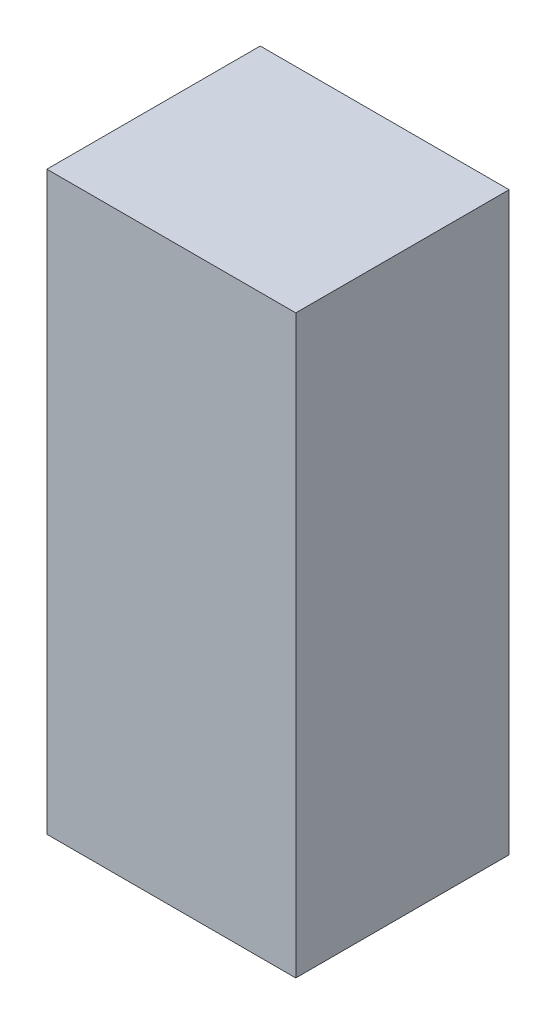
ISO-10303-21;
HEADER;
FILE_DESCRIPTION(('STEP AP214'),'2;1');
FILE_NAME('part.step','',(''),(''),'','','');
FILE_SCHEMA(('AUTOMOTIVE_DESIGN { 1 0 10303 214 1 1 1 1 }'));
ENDSEC;
DATA;
#1=APPLICATION_CONTEXT('core data for automotive mechanical design processes');
#2=APPLICATION_PROTOCOL_DEFINITION('international standard','automotive_design',2000,#1);
#3=PRODUCT_CONTEXT('',#1,'mechanical');
#4=PRODUCT('Part','Part','',(#3));
#5=PRODUCT_RELATED_PRODUCT_CATEGORY('part','',(#4));
#6=PRODUCT_DEFINITION_FORMATION('','',#4);
#7=PRODUCT_DEFINITION_CONTEXT('part definition',#1,'design');
#8=PRODUCT_DEFINITION('design','',#6,#7);
#9=PRODUCT_DEFINITION_SHAPE('','',#8);
#10=(LENGTH_UNIT() NAMED_UNIT(*) SI_UNIT(.MILLI.,.METRE.));
#11=(NAMED_UNIT(*) PLANE_ANGLE_UNIT() SI_UNIT($,.RADIAN.));
#12=(NAMED_UNIT(*) SI_UNIT($,.STERADIAN.) SOLID_ANGLE_UNIT());
#13=UNCERTAINTY_MEASURE_WITH_UNIT(LENGTH_MEASURE(1.E-05),#10,'distance_accuracy_value','');
#14=(GEOMETRIC_REPRESENTATION_CONTEXT(3) GLOBAL_UNCERTAINTY_ASSIGNED_CONTEXT((#13)) GLOBAL_UNIT_ASSIGNED_CONTEXT((#10,
#11,#12)) REPRESENTATION_CONTEXT('',''));
#15=CARTESIAN_POINT('',(0.,0.,0.));
#16=DIRECTION('',(0.,0.,1.));
#17=DIRECTION('',(1.,0.,0.));
#18=AXIS2_PLACEMENT_3D('',#15,#16,#17);
#19=CARTESIAN_POINT('',(0.,405.,0.));
#20=DIRECTION('',(1.,0.,0.));
#21=DIRECTION('',(0.,0.,-1.));
#22=AXIS2_PLACEMENT_3D('',#19,#20,#21);
#23=PLANE('',#22);
#24=DIRECTION('',(0.,0.,1.));
#25=VECTOR('',#24,1.);
#26=CARTESIAN_POINT('',(0.,0.,0.));
#27=LINE('',#26,#25);
#28=CARTESIAN_POINT('',(0.,0.,-150.));
#29=VERTEX_POINT('',#28);
#30=CARTESIAN_POINT('',(0.,0.,0.));
#31=VERTEX_POINT('',#30);
#32=EDGE_CURVE('E96',#29,#31,#27,.T.);
#33=ORIENTED_EDGE('',*,*,#32,.T.);
#34=DIRECTION('',(0.,-1.,0.));
#35=VECTOR('',#34,1.);
#36=CARTESIAN_POINT('',(0.,405.,0.));
#37=LINE('',#36,#35);
#38=CARTESIAN_POINT('',(0.,405.,0.));
#39=VERTEX_POINT('',#38);
#40=EDGE_CURVE('E11',#39,#31,#37,.T.);
#41=ORIENTED_EDGE('',*,*,#40,.F.);
#42=DIRECTION('',(0.,0.,1.));
#43=VECTOR('',#42,1.);
#44=CARTESIAN_POINT('',(0.,405.,0.));
#45=LINE('',#44,#43);
#46=CARTESIAN_POINT('',(0.,405.,-150.));
#47=VERTEX_POINT('',#46);
#48=EDGE_CURVE('E84',#47,#39,#45,.T.);
#49=ORIENTED_EDGE('',*,*,#48,.F.);
#50=DIRECTION('',(0.,-1.,0.));
#51=VECTOR('',#50,1.);
#52=CARTESIAN_POINT('',(0.,405.,-150.));
#53=LINE('',#52,#51);
#54=EDGE_CURVE('E92',#47,#29,#53,.T.);
#55=ORIENTED_EDGE('',*,*,#54,.T.);
#56=EDGE_LOOP('',(#33,#41,#49,#55));
#57=FACE_BOUND('',#56,.T.);
#58=ADVANCED_FACE('F33',(#57),#23,.F.);
#59=CARTESIAN_POINT('',(0.,405.,0.));
#60=DIRECTION('',(0.,0.,-1.));
#61=DIRECTION('',(-1.,0.,0.));
#62=AXIS2_PLACEMENT_3D('',#59,#60,#61);
#63=PLANE('',#62);
#64=DIRECTION('',(1.,0.,0.));
#65=VECTOR('',#64,1.);
#66=CARTESIAN_POINT('',(0.,0.,0.));
#67=LINE('',#66,#65);
#68=CARTESIAN_POINT('',(175.,0.,0.));
#69=VERTEX_POINT('',#68);
#70=EDGE_CURVE('E88',#31,#69,#67,.T.);
#71=ORIENTED_EDGE('',*,*,#70,.T.);
#72=DIRECTION('',(0.,-1.,0.));
#73=VECTOR('',#72,1.);
#74=CARTESIAN_POINT('',(175.,405.,0.));
#75=LINE('',#74,#73);
#76=CARTESIAN_POINT('',(175.,405.,0.));
#77=VERTEX_POINT('',#76);
#78=EDGE_CURVE('E41',#77,#69,#75,.T.);
#79=ORIENTED_EDGE('',*,*,#78,.F.);
#80=DIRECTION('',(1.,0.,0.));
#81=VECTOR('',#80,1.);
#82=CARTESIAN_POINT('',(0.,405.,0.));
#83=LINE('',#82,#81);
#84=EDGE_CURVE('E79',#39,#77,#83,.T.);
#85=ORIENTED_EDGE('',*,*,#84,.F.);
#86=ORIENTED_EDGE('',*,*,#40,.T.);
#87=EDGE_LOOP('',(#71,#79,#85,#86));
#88=FACE_BOUND('',#87,.T.);
#89=ADVANCED_FACE('F87',(#88),#63,.F.);
#90=CARTESIAN_POINT('',(175.,405.,0.));
#91=DIRECTION('',(-1.,0.,0.));
#92=DIRECTION('',(0.,0.,1.));
#93=AXIS2_PLACEMENT_3D('',#90,#91,#92);
#94=PLANE('',#93);
#95=DIRECTION('',(0.,0.,-1.));
#96=VECTOR('',#95,1.);
#97=CARTESIAN_POINT('',(175.,0.,0.));
#98=LINE('',#97,#96);
#99=CARTESIAN_POINT('',(175.,0.,-150.));
#100=VERTEX_POINT('',#99);
#101=EDGE_CURVE('E66',#69,#100,#98,.T.);
#102=ORIENTED_EDGE('',*,*,#101,.T.);
#103=DIRECTION('',(0.,-1.,0.));
#104=VECTOR('',#103,1.);
#105=CARTESIAN_POINT('',(175.,405.,-150.));
#106=LINE('',#105,#104);
#107=CARTESIAN_POINT('',(175.,405.,-150.));
#108=VERTEX_POINT('',#107);
#109=EDGE_CURVE('E89',#108,#100,#106,.T.);
#110=ORIENTED_EDGE('',*,*,#109,.F.);
#111=DIRECTION('',(0.,0.,-1.));
#112=VECTOR('',#111,1.);
#113=CARTESIAN_POINT('',(175.,405.,0.));
#114=LINE('',#113,#112);
#115=EDGE_CURVE('E82',#77,#108,#114,.T.);
#116=ORIENTED_EDGE('',*,*,#115,.F.);
#117=ORIENTED_EDGE('',*,*,#78,.T.);
#118=EDGE_LOOP('',(#102,#110,#116,#117));
#119=FACE_BOUND('',#118,.T.);
#120=ADVANCED_FACE('F90',(#119),#94,.F.);
#121=CARTESIAN_POINT('',(0.,405.,-150.));
#122=DIRECTION('',(0.,0.,1.));
#123=DIRECTION('',(1.,0.,0.));
#124=AXIS2_PLACEMENT_3D('',#121,#122,#123);
#125=PLANE('',#124);
#126=DIRECTION('',(-1.,0.,0.));
#127=VECTOR('',#126,1.);
#128=CARTESIAN_POINT('',(0.,0.,-150.));
#129=LINE('',#128,#127);
#130=EDGE_CURVE('E72',#100,#29,#129,.T.);
#131=ORIENTED_EDGE('',*,*,#130,.T.);
#132=ORIENTED_EDGE('',*,*,#54,.F.);
#133=DIRECTION('',(-1.,0.,0.));
#134=VECTOR('',#133,1.);
#135=CARTESIAN_POINT('',(0.,405.,-150.));
#136=LINE('',#135,#134);
#137=EDGE_CURVE('E49',#108,#47,#136,.T.);
#138=ORIENTED_EDGE('',*,*,#137,.F.);
#139=ORIENTED_EDGE('',*,*,#109,.T.);
#140=EDGE_LOOP('',(#131,#132,#138,#139));
#141=FACE_BOUND('',#140,.T.);
#142=ADVANCED_FACE('F103',(#141),#125,.F.);
#143=CARTESIAN_POINT('',(0.,405.,0.));
#144=DIRECTION('',(0.,-1.,0.));
#145=DIRECTION('',(0.,0.,-1.));
#146=AXIS2_PLACEMENT_3D('',#143,#144,#145);
#147=PLANE('',#146);
#148=ORIENTED_EDGE('',*,*,#48,.T.);
#149=ORIENTED_EDGE('',*,*,#84,.T.);
#150=ORIENTED_EDGE('',*,*,#115,.T.);
#151=ORIENTED_EDGE('',*,*,#137,.T.);
#152=EDGE_LOOP('',(#148,#149,#150,#151));
#153=FACE_BOUND('',#152,.T.);
#154=ADVANCED_FACE('F80',(#153),#147,.F.);
#155=CARTESIAN_POINT('',(0.,0.,0.));
#156=DIRECTION('',(0.,-1.,0.));
#157=DIRECTION('',(0.,0.,-1.));
#158=AXIS2_PLACEMENT_3D('',#155,#156,#157);
#159=PLANE('',#158);
#160=ORIENTED_EDGE('',*,*,#32,.F.);
#161=ORIENTED_EDGE('',*,*,#130,.F.);
#162=ORIENTED_EDGE('',*,*,#101,.F.);
#163=ORIENTED_EDGE('',*,*,#70,.F.);
#164=EDGE_LOOP('',(#160,#161,#162,#163));
#165=FACE_BOUND('',#164,.T.);
#166=ADVANCED_FACE('F106',(#165),#159,.T.);
#167=CLOSED_SHELL('',(#58,#89,#120,#142,#154,#166));
#168=MANIFOLD_SOLID_BREP('B2',#167);
#169=ADVANCED_BREP_SHAPE_REPRESENTATION('',(#18,#168),#14);
#170=SHAPE_DEFINITION_REPRESENTATION(#9,#169);
ENDSEC;
END-ISO-10303-21;
